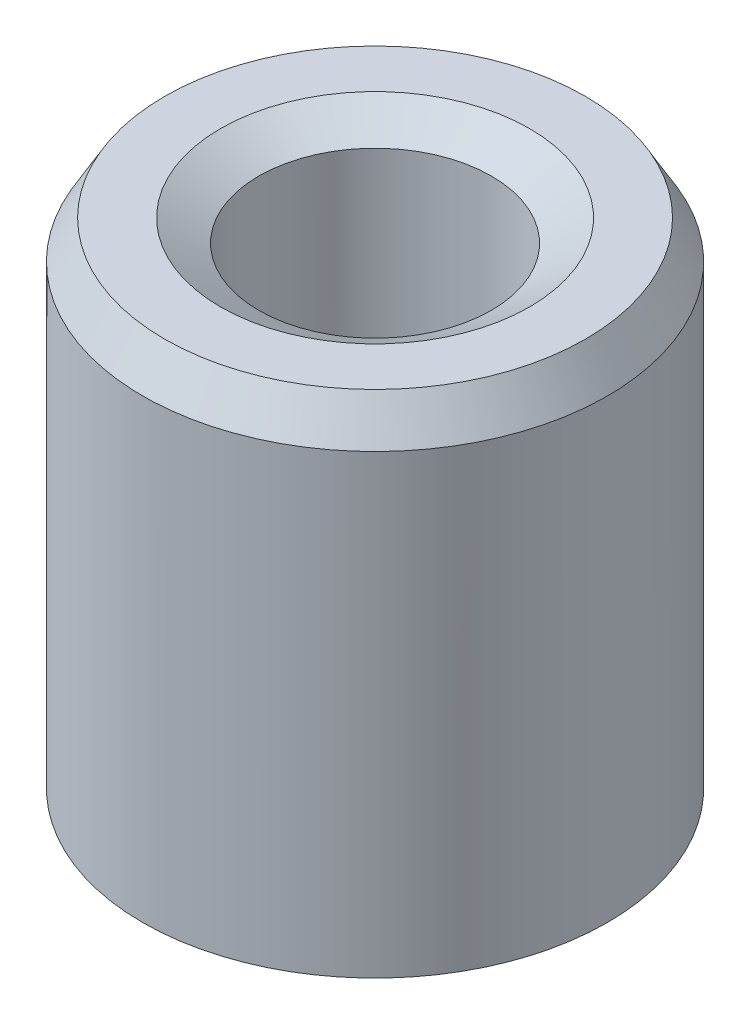
ISO-10303-21;
HEADER;
FILE_DESCRIPTION(('STEP AP214'),'2;1');
FILE_NAME('part.step','',(''),(''),'','','');
FILE_SCHEMA(('AUTOMOTIVE_DESIGN { 1 0 10303 214 1 1 1 1 }'));
ENDSEC;
DATA;
#1=APPLICATION_CONTEXT('core data for automotive mechanical design processes');
#2=APPLICATION_PROTOCOL_DEFINITION('international standard','automotive_design',2000,#1);
#3=PRODUCT_CONTEXT('',#1,'mechanical');
#4=PRODUCT('Part','Part','',(#3));
#5=PRODUCT_RELATED_PRODUCT_CATEGORY('part','',(#4));
#6=PRODUCT_DEFINITION_FORMATION('','',#4);
#7=PRODUCT_DEFINITION_CONTEXT('part definition',#1,'design');
#8=PRODUCT_DEFINITION('design','',#6,#7);
#9=PRODUCT_DEFINITION_SHAPE('','',#8);
#10=(LENGTH_UNIT() NAMED_UNIT(*) SI_UNIT(.MILLI.,.METRE.));
#11=(NAMED_UNIT(*) PLANE_ANGLE_UNIT() SI_UNIT($,.RADIAN.));
#12=(NAMED_UNIT(*) SI_UNIT($,.STERADIAN.) SOLID_ANGLE_UNIT());
#13=UNCERTAINTY_MEASURE_WITH_UNIT(LENGTH_MEASURE(1.E-05),#10,'distance_accuracy_value','');
#14=(GEOMETRIC_REPRESENTATION_CONTEXT(3) GLOBAL_UNCERTAINTY_ASSIGNED_CONTEXT((#13)) GLOBAL_UNIT_ASSIGNED_CONTEXT((#10,
#11,#12)) REPRESENTATION_CONTEXT('',''));
#15=CARTESIAN_POINT('',(0.,0.,0.));
#16=DIRECTION('',(0.,0.,1.));
#17=DIRECTION('',(1.,0.,0.));
#18=AXIS2_PLACEMENT_3D('',#15,#16,#17);
#19=CARTESIAN_POINT('',(0.,27.7689172693128,0.));
#20=DIRECTION('',(0.,-1.,0.));
#21=DIRECTION('',(0.,0.,-1.));
#22=AXIS2_PLACEMENT_3D('',#19,#20,#21);
#23=CYLINDRICAL_SURFACE('',#22,12.5);
#24=CARTESIAN_POINT('',(0.,1.18546672822958,0.));
#25=DIRECTION('',(0.,1.,0.));
#26=DIRECTION('',(0.,0.,1.));
#27=AXIS2_PLACEMENT_3D('',#24,#25,#26);
#28=CIRCLE('',#27,12.5);
#29=CARTESIAN_POINT('',(0.,1.18546672822957,-12.5));
#30=VERTEX_POINT('',#29);
#31=EDGE_CURVE('E10',#30,#30,#28,.T.);
#32=CARTESIAN_POINT('',(0.,25.7156286653368,0.));
#33=DIRECTION('',(0.,1.,0.));
#34=DIRECTION('',(0.,0.,1.));
#35=AXIS2_PLACEMENT_3D('',#32,#33,#34);
#36=CIRCLE('',#35,12.5);
#37=CARTESIAN_POINT('',(0.,25.7156286653368,-12.5));
#38=VERTEX_POINT('',#37);
#39=EDGE_CURVE('E50',#38,#38,#36,.F.);
#40=CARTESIAN_POINT('',(0.,1.18546672822957,-12.5));
#41=CARTESIAN_POINT('',(0.,1.44098924840777,-12.5));
#42=CARTESIAN_POINT('',(0.,1.69651176858597,-12.5));
#43=CARTESIAN_POINT('',(0.,2.20755680894237,-12.5));
#44=CARTESIAN_POINT('',(0.,2.46307932912057,-12.5));
#45=CARTESIAN_POINT('',(0.,2.97412436947698,-12.5));
#46=CARTESIAN_POINT('',(0.,3.22964688965518,-12.5));
#47=CARTESIAN_POINT('',(0.,3.74069193001158,-12.5));
#48=CARTESIAN_POINT('',(0.,3.99621445018978,-12.5));
#49=CARTESIAN_POINT('',(0.,4.50725949054618,-12.5));
#50=CARTESIAN_POINT('',(0.,4.76278201072438,-12.5));
#51=CARTESIAN_POINT('',(0.,5.27382705108078,-12.5));
#52=CARTESIAN_POINT('',(0.,5.52934957125898,-12.5));
#53=CARTESIAN_POINT('',(0.,6.04039461161538,-12.5));
#54=CARTESIAN_POINT('',(0.,6.29591713179358,-12.5));
#55=CARTESIAN_POINT('',(0.,6.80696217214998,-12.5));
#56=CARTESIAN_POINT('',(0.,7.06248469232818,-12.5));
#57=CARTESIAN_POINT('',(0.,7.57352973268458,-12.5));
#58=CARTESIAN_POINT('',(0.,7.82905225286278,-12.5));
#59=CARTESIAN_POINT('',(0.,8.34009729321918,-12.5));
#60=CARTESIAN_POINT('',(0.,8.59561981339738,-12.5));
#61=CARTESIAN_POINT('',(0.,9.10666485375378,-12.5));
#62=CARTESIAN_POINT('',(0.,9.36218737393198,-12.5));
#63=CARTESIAN_POINT('',(0.,9.87323241428838,-12.5));
#64=CARTESIAN_POINT('',(0.,10.1287549344666,-12.5));
#65=CARTESIAN_POINT('',(0.,10.639799974823,-12.5));
#66=CARTESIAN_POINT('',(0.,10.8953224950012,-12.5));
#67=CARTESIAN_POINT('',(0.,11.4063675353576,-12.5));
#68=CARTESIAN_POINT('',(0.,11.6618900555358,-12.5));
#69=CARTESIAN_POINT('',(0.,12.1729350958922,-12.5));
#70=CARTESIAN_POINT('',(0.,12.4284576160704,-12.5));
#71=CARTESIAN_POINT('',(0.,12.9395026564268,-12.5));
#72=CARTESIAN_POINT('',(0.,13.195025176605,-12.5));
#73=CARTESIAN_POINT('',(0.,13.7060702169614,-12.5));
#74=CARTESIAN_POINT('',(0.,13.9615927371396,-12.5));
#75=CARTESIAN_POINT('',(0.,14.472637777496,-12.5));
#76=CARTESIAN_POINT('',(0.,14.7281602976742,-12.5));
#77=CARTESIAN_POINT('',(0.,15.2392053380306,-12.5));
#78=CARTESIAN_POINT('',(0.,15.4947278582088,-12.5));
#79=CARTESIAN_POINT('',(0.,16.0057728985652,-12.5));
#80=CARTESIAN_POINT('',(0.,16.2612954187434,-12.5));
#81=CARTESIAN_POINT('',(0.,16.7723404590998,-12.5));
#82=CARTESIAN_POINT('',(0.,17.027862979278,-12.5));
#83=CARTESIAN_POINT('',(0.,17.5389080196344,-12.5));
#84=CARTESIAN_POINT('',(0.,17.7944305398126,-12.5));
#85=CARTESIAN_POINT('',(0.,18.305475580169,-12.5));
#86=CARTESIAN_POINT('',(0.,18.5609981003472,-12.5));
#87=CARTESIAN_POINT('',(0.,19.0720431407036,-12.5));
#88=CARTESIAN_POINT('',(0.,19.3275656608818,-12.5));
#89=CARTESIAN_POINT('',(0.,19.8386107012382,-12.5));
#90=CARTESIAN_POINT('',(0.,20.0941332214164,-12.5));
#91=CARTESIAN_POINT('',(0.,20.6051782617728,-12.5));
#92=CARTESIAN_POINT('',(0.,20.860700781951,-12.5));
#93=CARTESIAN_POINT('',(0.,21.3717458223074,-12.5));
#94=CARTESIAN_POINT('',(0.,21.6272683424856,-12.5));
#95=CARTESIAN_POINT('',(0.,22.138313382842,-12.5));
#96=CARTESIAN_POINT('',(0.,22.3938359030202,-12.5));
#97=CARTESIAN_POINT('',(0.,22.9048809433766,-12.5));
#98=CARTESIAN_POINT('',(0.,23.1604034635548,-12.5));
#99=CARTESIAN_POINT('',(0.,23.6714485039112,-12.5));
#100=CARTESIAN_POINT('',(0.,23.9269710240894,-12.5));
#101=CARTESIAN_POINT('',(0.,24.4380160644458,-12.5));
#102=CARTESIAN_POINT('',(0.,24.693538584624,-12.5));
#103=CARTESIAN_POINT('',(0.,25.2045836249804,-12.5));
#104=CARTESIAN_POINT('',(0.,25.4601061451586,-12.5));
#105=CARTESIAN_POINT('',(0.,25.7156286653368,-12.5));
#106=B_SPLINE_CURVE_WITH_KNOTS('',3,(#40,#41,#42,#43,#44,#45,#46,#47,#48,#49,#50,#51,#52,#53,
#54,#55,#56,#57,#58,#59,#60,#61,#62,#63,#64,#65,#66,#67,#68,#69,#70,#71,#72,#73,#74,#75,#76,#77,
#78,#79,#80,#81,#82,#83,#84,#85,#86,#87,#88,#89,#90,#91,#92,#93,#94,#95,#96,#97,#98,#99,#100,
#101,#102,#103,#104,#105),.UNSPECIFIED.,.F.,.F.,(4,2,2,2,2,2,2,2,2,2,2,2,2,2,2,2,2,2,2,2,2,2,2,
2,2,2,2,2,2,2,2,2,4),(0.,0.766567560534601,1.5331351210692,2.2997026816038,3.0662702421384,
3.832837802673,4.5994053632076,5.3659729237422,6.1325404842768,6.89910804481141,
7.66567560534601,8.43224316588061,9.19881072641521,9.96537828694981,10.7319458474844,
11.498513408019,12.2650809685536,13.0316485290882,13.7982160896228,14.5647836501574,
15.331351210692,16.0979187712266,16.8644863317612,17.6310538922958,18.3976214528304,
19.164189013365,19.9307565738996,20.6973241344342,21.4638916949688,22.2304592555034,
22.997026816038,23.7635943765726,24.5301619371072),.UNSPECIFIED.);
#107=EDGE_CURVE('BSEAM39',#30,#38,#106,.T.);
#108=ORIENTED_EDGE('',*,*,#31,.T.);
#109=ORIENTED_EDGE('',*,*,#39,.T.);
#110=ORIENTED_EDGE('',*,*,#107,.T.);
#111=ORIENTED_EDGE('',*,*,#107,.F.);
#112=EDGE_LOOP('',(#108,#110,#109,#111));
#113=FACE_BOUND('',#112,.T.);
#114=ADVANCED_FACE('F39',(#113),#23,.T.);
#115=CARTESIAN_POINT('',(0.,27.7689172693128,0.));
#116=DIRECTION('',(0.,1.,0.));
#117=DIRECTION('',(0.,0.,1.));
#118=AXIS2_PLACEMENT_3D('',#115,#116,#117);
#119=PLANE('',#118);
#120=CARTESIAN_POINT('',(0.,27.7689172693128,0.));
#121=DIRECTION('',(0.,1.,0.));
#122=DIRECTION('',(0.,0.,1.));
#123=AXIS2_PLACEMENT_3D('',#120,#121,#122);
#124=CIRCLE('',#123,8.3115397086875);
#125=CARTESIAN_POINT('',(0.,27.7689172693128,8.3115397086875));
#126=VERTEX_POINT('',#125);
#127=EDGE_CURVE('E58',#126,#126,#124,.F.);
#128=ORIENTED_EDGE('',*,*,#127,.T.);
#129=EDGE_LOOP('',(#128));
#130=FACE_BOUND('',#129,.T.);
#131=CARTESIAN_POINT('',(0.,27.7689172693128,0.));
#132=DIRECTION('',(0.,1.,0.));
#133=DIRECTION('',(0.,0.,1.));
#134=AXIS2_PLACEMENT_3D('',#131,#132,#133);
#135=CIRCLE('',#134,11.3145332717705);
#136=CARTESIAN_POINT('',(0.,27.7689172693128,11.3145332717705));
#137=VERTEX_POINT('',#136);
#138=EDGE_CURVE('E61',#137,#137,#135,.T.);
#139=ORIENTED_EDGE('',*,*,#138,.T.);
#140=EDGE_LOOP('',(#139));
#141=FACE_BOUND('',#140,.T.);
#142=ADVANCED_FACE('F88',(#130,#141),#119,.T.);
#143=CARTESIAN_POINT('',(0.,0.,0.));
#144=DIRECTION('',(0.,1.,0.));
#145=DIRECTION('',(0.,0.,1.));
#146=AXIS2_PLACEMENT_3D('',#143,#144,#145);
#147=PLANE('',#146);
#148=CARTESIAN_POINT('',(0.,0.,0.));
#149=DIRECTION('',(0.,1.,0.));
#150=DIRECTION('',(0.,0.,1.));
#151=AXIS2_PLACEMENT_3D('',#148,#149,#150);
#152=CIRCLE('',#151,7.44371783294097);
#153=CARTESIAN_POINT('',(0.,0.,7.44371783294097));
#154=VERTEX_POINT('',#153);
#155=EDGE_CURVE('E51',#154,#154,#152,.T.);
#156=ORIENTED_EDGE('',*,*,#155,.T.);
#157=EDGE_LOOP('',(#156));
#158=FACE_BOUND('',#157,.T.);
#159=CARTESIAN_POINT('',(0.,0.,0.));
#160=DIRECTION('',(0.,1.,0.));
#161=DIRECTION('',(0.,0.,1.));
#162=AXIS2_PLACEMENT_3D('',#159,#160,#161);
#163=CIRCLE('',#162,10.4467113960239);
#164=CARTESIAN_POINT('',(0.,0.,10.4467113960239));
#165=VERTEX_POINT('',#164);
#166=EDGE_CURVE('E54',#165,#165,#163,.F.);
#167=ORIENTED_EDGE('',*,*,#166,.T.);
#168=EDGE_LOOP('',(#167));
#169=FACE_BOUND('',#168,.T.);
#170=ADVANCED_FACE('F83',(#158,#169),#147,.F.);
#171=CARTESIAN_POINT('',(0.,27.7689172693128,0.));
#172=DIRECTION('',(0.,-1.,0.));
#173=DIRECTION('',(0.,0.,-1.));
#174=AXIS2_PLACEMENT_3D('',#171,#172,#173);
#175=CYLINDRICAL_SURFACE('',#174,6.25825110471141);
#176=CARTESIAN_POINT('',(0.,26.5834505410832,0.));
#177=DIRECTION('',(0.,1.,0.));
#178=DIRECTION('',(0.,0.,1.));
#179=AXIS2_PLACEMENT_3D('',#176,#177,#178);
#180=CIRCLE('',#179,6.25825110471141);
#181=CARTESIAN_POINT('',(0.,26.5834505410832,-6.25825110471141));
#182=VERTEX_POINT('',#181);
#183=EDGE_CURVE('E67',#182,#182,#180,.T.);
#184=CARTESIAN_POINT('',(0.,2.05328860397607,0.));
#185=DIRECTION('',(0.,1.,0.));
#186=DIRECTION('',(0.,0.,1.));
#187=AXIS2_PLACEMENT_3D('',#184,#185,#186);
#188=CIRCLE('',#187,6.25825110471141);
#189=CARTESIAN_POINT('',(0.,2.05328860397607,-6.25825110471141));
#190=VERTEX_POINT('',#189);
#191=EDGE_CURVE('E69',#190,#190,#188,.F.);
#192=CARTESIAN_POINT('',(0.,26.5834505410832,-6.25825110471141));
#193=CARTESIAN_POINT('',(0.,26.327928020905,-6.25825110471141));
#194=CARTESIAN_POINT('',(0.,26.0724055007268,-6.25825110471141));
#195=CARTESIAN_POINT('',(0.,25.5613604603704,-6.25825110471141));
#196=CARTESIAN_POINT('',(0.,25.3058379401922,-6.25825110471141));
#197=CARTESIAN_POINT('',(0.,24.7947928998358,-6.25825110471141));
#198=CARTESIAN_POINT('',(0.,24.5392703796576,-6.25825110471141));
#199=CARTESIAN_POINT('',(0.,24.0282253393012,-6.25825110471141));
#200=CARTESIAN_POINT('',(0.,23.772702819123,-6.25825110471141));
#201=CARTESIAN_POINT('',(0.,23.2616577787666,-6.25825110471141));
#202=CARTESIAN_POINT('',(0.,23.0061352585884,-6.25825110471141));
#203=CARTESIAN_POINT('',(0.,22.495090218232,-6.25825110471141));
#204=CARTESIAN_POINT('',(0.,22.2395676980538,-6.25825110471141));
#205=CARTESIAN_POINT('',(0.,21.7285226576974,-6.25825110471141));
#206=CARTESIAN_POINT('',(0.,21.4730001375192,-6.25825110471141));
#207=CARTESIAN_POINT('',(0.,20.9619550971628,-6.25825110471141));
#208=CARTESIAN_POINT('',(0.,20.7064325769846,-6.25825110471141));
#209=CARTESIAN_POINT('',(0.,20.1953875366282,-6.25825110471141));
#210=CARTESIAN_POINT('',(0.,19.93986501645,-6.25825110471141));
#211=CARTESIAN_POINT('',(0.,19.4288199760936,-6.25825110471141));
#212=CARTESIAN_POINT('',(0.,19.1732974559154,-6.25825110471141));
#213=CARTESIAN_POINT('',(0.,18.662252415559,-6.25825110471141));
#214=CARTESIAN_POINT('',(0.,18.4067298953808,-6.25825110471141));
#215=CARTESIAN_POINT('',(0.,17.8956848550244,-6.25825110471141));
#216=CARTESIAN_POINT('',(0.,17.6401623348462,-6.25825110471141));
#217=CARTESIAN_POINT('',(0.,17.1291172944898,-6.25825110471141));
#218=CARTESIAN_POINT('',(0.,16.8735947743116,-6.25825110471141));
#219=CARTESIAN_POINT('',(0.,16.3625497339552,-6.25825110471141));
#220=CARTESIAN_POINT('',(0.,16.107027213777,-6.25825110471141));
#221=CARTESIAN_POINT('',(0.,15.5959821734206,-6.25825110471141));
#222=CARTESIAN_POINT('',(0.,15.3404596532424,-6.25825110471141));
#223=CARTESIAN_POINT('',(0.,14.829414612886,-6.25825110471141));
#224=CARTESIAN_POINT('',(0.,14.5738920927078,-6.25825110471141));
#225=CARTESIAN_POINT('',(0.,14.0628470523514,-6.25825110471141));
#226=CARTESIAN_POINT('',(0.,13.8073245321732,-6.25825110471141));
#227=CARTESIAN_POINT('',(0.,13.2962794918168,-6.25825110471141));
#228=CARTESIAN_POINT('',(0.,13.0407569716386,-6.25825110471141));
#229=CARTESIAN_POINT('',(0.,12.5297119312822,-6.25825110471141));
#230=CARTESIAN_POINT('',(0.,12.2741894111041,-6.25825110471141));
#231=CARTESIAN_POINT('',(0.,11.7631443707477,-6.25825110471141));
#232=CARTESIAN_POINT('',(0.,11.5076218505695,-6.25825110471141));
#233=CARTESIAN_POINT('',(0.,10.996576810213,-6.25825110471141));
#234=CARTESIAN_POINT('',(0.,10.7410542900348,-6.25825110471141));
#235=CARTESIAN_POINT('',(0.,10.2300092496785,-6.25825110471141));
#236=CARTESIAN_POINT('',(0.,9.97448672950025,-6.25825110471141));
#237=CARTESIAN_POINT('',(0.,9.46344168914385,-6.25825110471141));
#238=CARTESIAN_POINT('',(0.,9.20791916896565,-6.25825110471141));
#239=CARTESIAN_POINT('',(0.,8.69687412860926,-6.25825110471141));
#240=CARTESIAN_POINT('',(0.,8.44135160843106,-6.25825110471141));
#241=CARTESIAN_POINT('',(0.,7.93030656807466,-6.25825110471141));
#242=CARTESIAN_POINT('',(0.,7.67478404789646,-6.25825110471141));
#243=CARTESIAN_POINT('',(0.,7.16373900754006,-6.25825110471141));
#244=CARTESIAN_POINT('',(0.,6.90821648736186,-6.25825110471141));
#245=CARTESIAN_POINT('',(0.,6.39717144700546,-6.25825110471141));
#246=CARTESIAN_POINT('',(0.,6.14164892682726,-6.25825110471141));
#247=CARTESIAN_POINT('',(0.,5.63060388647086,-6.25825110471141));
#248=CARTESIAN_POINT('',(0.,5.37508136629266,-6.25825110471141));
#249=CARTESIAN_POINT('',(0.,4.86403632593626,-6.25825110471141));
#250=CARTESIAN_POINT('',(0.,4.60851380575806,-6.25825110471141));
#251=CARTESIAN_POINT('',(0.,4.09746876540166,-6.25825110471141));
#252=CARTESIAN_POINT('',(0.,3.84194624522346,-6.25825110471141));
#253=CARTESIAN_POINT('',(0.,3.33090120486706,-6.25825110471141));
#254=CARTESIAN_POINT('',(0.,3.07537868468886,-6.25825110471141));
#255=CARTESIAN_POINT('',(0.,2.56433364433247,-6.25825110471141));
#256=CARTESIAN_POINT('',(0.,2.30881112415427,-6.25825110471141));
#257=CARTESIAN_POINT('',(0.,2.05328860397607,-6.25825110471141));
#258=B_SPLINE_CURVE_WITH_KNOTS('',3,(#192,#193,#194,#195,#196,#197,#198,#199,#200,#201,#202,
#203,#204,#205,#206,#207,#208,#209,#210,#211,#212,#213,#214,#215,#216,#217,#218,#219,#220,#221,
#222,#223,#224,#225,#226,#227,#228,#229,#230,#231,#232,#233,#234,#235,#236,#237,#238,#239,#240,
#241,#242,#243,#244,#245,#246,#247,#248,#249,#250,#251,#252,#253,#254,#255,#256,#257),
.UNSPECIFIED.,.F.,.F.,(4,2,2,2,2,2,2,2,2,2,2,2,2,2,2,2,2,2,2,2,2,2,2,2,2,2,2,2,2,2,2,2,4),(0.,
0.766567560534597,1.53313512106919,2.2997026816038,3.06627024213839,3.83283780267299,
4.59940536320759,5.36597292374219,6.13254048427679,6.89910804481138,7.66567560534598,
8.43224316588058,9.19881072641518,9.96537828694978,10.7319458474844,11.498513408019,
12.2650809685536,13.0316485290882,13.7982160896228,14.5647836501574,15.331351210692,
16.0979187712266,16.8644863317612,17.6310538922958,18.3976214528304,19.164189013365,
19.9307565738996,20.6973241344342,21.4638916949688,22.2304592555034,22.997026816038,
23.7635943765726,24.5301619371071),.UNSPECIFIED.);
#259=EDGE_CURVE('BSEAM71',#182,#190,#258,.T.);
#260=ORIENTED_EDGE('',*,*,#183,.T.);
#261=ORIENTED_EDGE('',*,*,#191,.T.);
#262=ORIENTED_EDGE('',*,*,#259,.T.);
#263=ORIENTED_EDGE('',*,*,#259,.F.);
#264=EDGE_LOOP('',(#260,#262,#261,#263));
#265=FACE_BOUND('',#264,.T.);
#266=ADVANCED_FACE('F71',(#265),#175,.F.);
#267=CARTESIAN_POINT('',(0.,26.5834505410832,0.));
#268=DIRECTION('',(0.,1.,0.));
#269=DIRECTION('',(0.,0.,1.));
#270=AXIS2_PLACEMENT_3D('',#267,#268,#269);
#271=CONICAL_SURFACE('',#270,6.25825110471141,1.0471975511966);
#272=ORIENTED_EDGE('',*,*,#127,.F.);
#273=EDGE_LOOP('',(#272));
#274=FACE_BOUND('',#273,.T.);
#275=ORIENTED_EDGE('',*,*,#183,.F.);
#276=EDGE_LOOP('',(#275));
#277=FACE_BOUND('',#276,.T.);
#278=ADVANCED_FACE('F77',(#274,#277),#271,.F.);
#279=CARTESIAN_POINT('',(0.,0.,0.));
#280=DIRECTION('',(0.,-1.,0.));
#281=DIRECTION('',(0.,0.,-1.));
#282=AXIS2_PLACEMENT_3D('',#279,#280,#281);
#283=CONICAL_SURFACE('',#282,7.44371783294097,0.523598775598295);
#284=ORIENTED_EDGE('',*,*,#191,.F.);
#285=EDGE_LOOP('',(#284));
#286=FACE_BOUND('',#285,.T.);
#287=ORIENTED_EDGE('',*,*,#155,.F.);
#288=EDGE_LOOP('',(#287));
#289=FACE_BOUND('',#288,.T.);
#290=ADVANCED_FACE('F73',(#286,#289),#283,.F.);
#291=CARTESIAN_POINT('',(0.,1.18546672822958,0.));
#292=DIRECTION('',(0.,1.,0.));
#293=DIRECTION('',(0.,0.,1.));
#294=AXIS2_PLACEMENT_3D('',#291,#292,#293);
#295=CONICAL_SURFACE('',#294,12.5,1.0471975511966);
#296=ORIENTED_EDGE('',*,*,#166,.F.);
#297=EDGE_LOOP('',(#296));
#298=FACE_BOUND('',#297,.T.);
#299=ORIENTED_EDGE('',*,*,#31,.F.);
#300=EDGE_LOOP('',(#299));
#301=FACE_BOUND('',#300,.T.);
#302=ADVANCED_FACE('F76',(#298,#301),#295,.T.);
#303=CARTESIAN_POINT('',(0.,27.7689172693128,0.));
#304=DIRECTION('',(0.,-1.,0.));
#305=DIRECTION('',(0.,0.,-1.));
#306=AXIS2_PLACEMENT_3D('',#303,#304,#305);
#307=CONICAL_SURFACE('',#306,11.3145332717705,0.523598775598295);
#308=ORIENTED_EDGE('',*,*,#39,.F.);
#309=EDGE_LOOP('',(#308));
#310=FACE_BOUND('',#309,.T.);
#311=ORIENTED_EDGE('',*,*,#138,.F.);
#312=EDGE_LOOP('',(#311));
#313=FACE_BOUND('',#312,.T.);
#314=ADVANCED_FACE('F45',(#310,#313),#307,.T.);
#315=CLOSED_SHELL('',(#114,#142,#170,#266,#278,#290,#302,#314));
#316=MANIFOLD_SOLID_BREP('B2',#315);
#317=ADVANCED_BREP_SHAPE_REPRESENTATION('',(#18,#316),#14);
#318=SHAPE_DEFINITION_REPRESENTATION(#9,#317);
ENDSEC;
END-ISO-10303-21;
